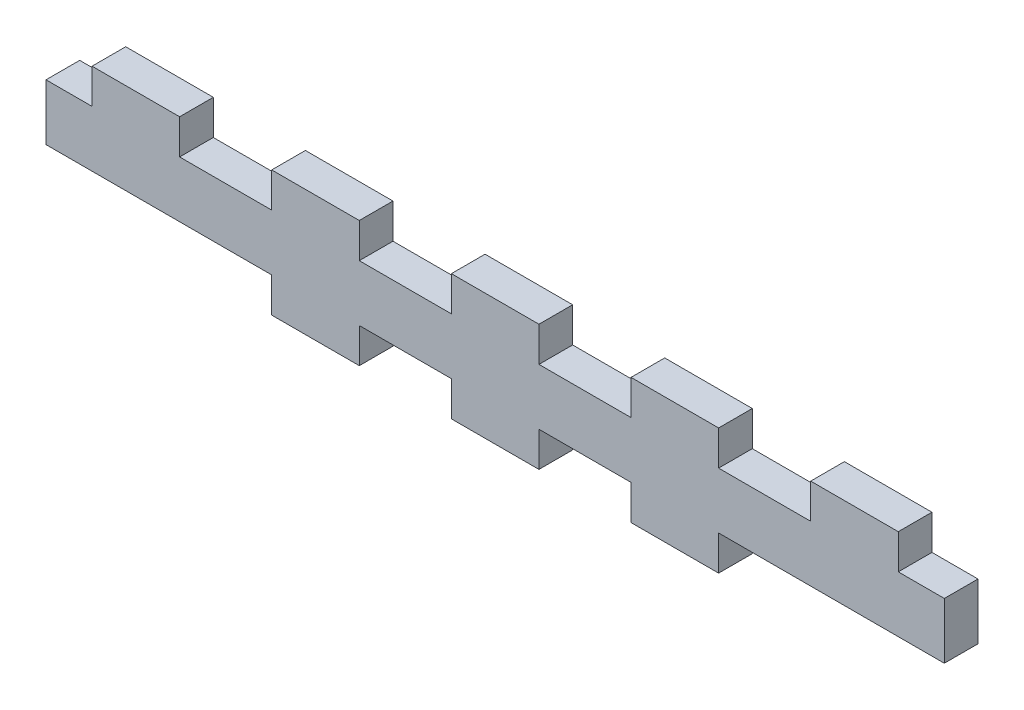
ISO-10303-21;
HEADER;
FILE_DESCRIPTION(('STEP AP214'),'2;1');
FILE_NAME('part.step','',(''),(''),'','','');
FILE_SCHEMA(('AUTOMOTIVE_DESIGN { 1 0 10303 214 1 1 1 1 }'));
ENDSEC;
DATA;
#1=APPLICATION_CONTEXT('core data for automotive mechanical design processes');
#2=APPLICATION_PROTOCOL_DEFINITION('international standard','automotive_design',2000,#1);
#3=PRODUCT_CONTEXT('',#1,'mechanical');
#4=PRODUCT('Part','Part','',(#3));
#5=PRODUCT_RELATED_PRODUCT_CATEGORY('part','',(#4));
#6=PRODUCT_DEFINITION_FORMATION('','',#4);
#7=PRODUCT_DEFINITION_CONTEXT('part definition',#1,'design');
#8=PRODUCT_DEFINITION('design','',#6,#7);
#9=PRODUCT_DEFINITION_SHAPE('','',#8);
#10=(LENGTH_UNIT() NAMED_UNIT(*) SI_UNIT(.MILLI.,.METRE.));
#11=(NAMED_UNIT(*) PLANE_ANGLE_UNIT() SI_UNIT($,.RADIAN.));
#12=(NAMED_UNIT(*) SI_UNIT($,.STERADIAN.) SOLID_ANGLE_UNIT());
#13=UNCERTAINTY_MEASURE_WITH_UNIT(LENGTH_MEASURE(1.E-05),#10,'distance_accuracy_value','');
#14=(GEOMETRIC_REPRESENTATION_CONTEXT(3) GLOBAL_UNCERTAINTY_ASSIGNED_CONTEXT((#13)) GLOBAL_UNIT_ASSIGNED_CONTEXT((#10,
#11,#12)) REPRESENTATION_CONTEXT('',''));
#15=CARTESIAN_POINT('',(0.,0.,0.));
#16=DIRECTION('',(0.,0.,1.));
#17=DIRECTION('',(1.,0.,0.));
#18=AXIS2_PLACEMENT_3D('',#15,#16,#17);
#19=CARTESIAN_POINT('',(0.,0.,2.99999999999999));
#20=DIRECTION('',(0.,0.,1.));
#21=DIRECTION('',(1.,0.,0.));
#22=AXIS2_PLACEMENT_3D('',#19,#20,#21);
#23=PLANE('',#22);
#24=DIRECTION('',(1.,0.,0.));
#25=VECTOR('',#24,1.);
#26=CARTESIAN_POINT('',(75.9000000000001,-3.10000000000001,2.99999999999999));
#27=LINE('',#26,#25);
#28=CARTESIAN_POINT('',(75.9000000000001,-3.10000000000001,2.99999999999999));
#29=VERTEX_POINT('',#28);
#30=CARTESIAN_POINT('',(80.,-3.10000000000001,2.99999999999999));
#31=VERTEX_POINT('',#30);
#32=EDGE_CURVE('E48',#29,#31,#27,.T.);
#33=ORIENTED_EDGE('',*,*,#32,.F.);
#34=DIRECTION('',(0.,-1.,0.));
#35=VECTOR('',#34,1.);
#36=CARTESIAN_POINT('',(75.9000000000001,0.1,2.99999999999999));
#37=LINE('',#36,#35);
#38=CARTESIAN_POINT('',(75.9000000000001,0.,2.99999999999999));
#39=VERTEX_POINT('',#38);
#40=EDGE_CURVE('E266',#39,#29,#37,.T.);
#41=ORIENTED_EDGE('',*,*,#40,.F.);
#42=DIRECTION('',(-1.,0.,0.));
#43=VECTOR('',#42,1.);
#44=CARTESIAN_POINT('',(0.,0.,2.99999999999999));
#45=LINE('',#44,#43);
#46=CARTESIAN_POINT('',(68.1000000000001,0.,2.99999999999999));
#47=VERTEX_POINT('',#46);
#48=EDGE_CURVE('E459',#39,#47,#45,.T.);
#49=ORIENTED_EDGE('',*,*,#48,.T.);
#50=DIRECTION('',(0.,1.,0.));
#51=VECTOR('',#50,1.);
#52=CARTESIAN_POINT('',(68.1000000000001,-3.10000000000001,2.99999999999999));
#53=LINE('',#52,#51);
#54=CARTESIAN_POINT('',(68.1000000000001,-3.10000000000001,2.99999999999999));
#55=VERTEX_POINT('',#54);
#56=EDGE_CURVE('E312',#55,#47,#53,.T.);
#57=ORIENTED_EDGE('',*,*,#56,.F.);
#58=DIRECTION('',(1.,0.,0.));
#59=VECTOR('',#58,1.);
#60=CARTESIAN_POINT('',(59.9000000000001,-3.10000000000001,2.99999999999999));
#61=LINE('',#60,#59);
#62=CARTESIAN_POINT('',(59.9000000000001,-3.10000000000001,2.99999999999999));
#63=VERTEX_POINT('',#62);
#64=EDGE_CURVE('E309',#63,#55,#61,.T.);
#65=ORIENTED_EDGE('',*,*,#64,.F.);
#66=DIRECTION('',(0.,-1.,0.));
#67=VECTOR('',#66,1.);
#68=CARTESIAN_POINT('',(59.9000000000001,0.1,2.99999999999999));
#69=LINE('',#68,#67);
#70=CARTESIAN_POINT('',(59.9000000000001,0.,2.99999999999999));
#71=VERTEX_POINT('',#70);
#72=EDGE_CURVE('E307',#71,#63,#69,.T.);
#73=ORIENTED_EDGE('',*,*,#72,.F.);
#74=CARTESIAN_POINT('',(52.1000000000001,0.,2.99999999999999));
#75=VERTEX_POINT('',#74);
#76=EDGE_CURVE('E462',#71,#75,#45,.T.);
#77=ORIENTED_EDGE('',*,*,#76,.T.);
#78=DIRECTION('',(0.,1.,0.));
#79=VECTOR('',#78,1.);
#80=CARTESIAN_POINT('',(52.1000000000001,-3.10000000000001,2.99999999999999));
#81=LINE('',#80,#79);
#82=CARTESIAN_POINT('',(52.1000000000001,-3.10000000000001,2.99999999999999));
#83=VERTEX_POINT('',#82);
#84=EDGE_CURVE('E56',#83,#75,#81,.T.);
#85=ORIENTED_EDGE('',*,*,#84,.F.);
#86=DIRECTION('',(1.,0.,0.));
#87=VECTOR('',#86,1.);
#88=CARTESIAN_POINT('',(43.9,-3.10000000000001,2.99999999999999));
#89=LINE('',#88,#87);
#90=CARTESIAN_POINT('',(43.9,-3.10000000000001,2.99999999999999));
#91=VERTEX_POINT('',#90);
#92=EDGE_CURVE('E291',#91,#83,#89,.T.);
#93=ORIENTED_EDGE('',*,*,#92,.F.);
#94=DIRECTION('',(0.,-1.,0.));
#95=VECTOR('',#94,1.);
#96=CARTESIAN_POINT('',(43.9,0.1,2.99999999999999));
#97=LINE('',#96,#95);
#98=CARTESIAN_POINT('',(43.9,0.,2.99999999999999));
#99=VERTEX_POINT('',#98);
#100=EDGE_CURVE('E289',#99,#91,#97,.T.);
#101=ORIENTED_EDGE('',*,*,#100,.F.);
#102=CARTESIAN_POINT('',(36.1,0.,2.99999999999999));
#103=VERTEX_POINT('',#102);
#104=EDGE_CURVE('E463',#99,#103,#45,.T.);
#105=ORIENTED_EDGE('',*,*,#104,.T.);
#106=DIRECTION('',(0.,1.,0.));
#107=VECTOR('',#106,1.);
#108=CARTESIAN_POINT('',(36.1,-3.10000000000001,2.99999999999999));
#109=LINE('',#108,#107);
#110=CARTESIAN_POINT('',(36.1,-3.10000000000001,2.99999999999999));
#111=VERTEX_POINT('',#110);
#112=EDGE_CURVE('E399',#111,#103,#109,.T.);
#113=ORIENTED_EDGE('',*,*,#112,.F.);
#114=DIRECTION('',(1.,0.,0.));
#115=VECTOR('',#114,1.);
#116=CARTESIAN_POINT('',(27.9,-3.10000000000001,2.99999999999999));
#117=LINE('',#116,#115);
#118=CARTESIAN_POINT('',(27.9,-3.10000000000001,2.99999999999999));
#119=VERTEX_POINT('',#118);
#120=EDGE_CURVE('E405',#119,#111,#117,.T.);
#121=ORIENTED_EDGE('',*,*,#120,.F.);
#122=DIRECTION('',(0.,-1.,0.));
#123=VECTOR('',#122,1.);
#124=CARTESIAN_POINT('',(27.9,0.1,2.99999999999999));
#125=LINE('',#124,#123);
#126=CARTESIAN_POINT('',(27.9,0.,2.99999999999999));
#127=VERTEX_POINT('',#126);
#128=EDGE_CURVE('E402',#127,#119,#125,.T.);
#129=ORIENTED_EDGE('',*,*,#128,.F.);
#130=CARTESIAN_POINT('',(20.1,0.,2.99999999999999));
#131=VERTEX_POINT('',#130);
#132=EDGE_CURVE('E464',#127,#131,#45,.T.);
#133=ORIENTED_EDGE('',*,*,#132,.T.);
#134=DIRECTION('',(0.,1.,0.));
#135=VECTOR('',#134,1.);
#136=CARTESIAN_POINT('',(20.1,-3.10000000000001,2.99999999999999));
#137=LINE('',#136,#135);
#138=CARTESIAN_POINT('',(20.1,-3.10000000000001,2.99999999999999));
#139=VERTEX_POINT('',#138);
#140=EDGE_CURVE('E380',#139,#131,#137,.T.);
#141=ORIENTED_EDGE('',*,*,#140,.F.);
#142=DIRECTION('',(1.,0.,0.));
#143=VECTOR('',#142,1.);
#144=CARTESIAN_POINT('',(11.8999999999999,-3.10000000000001,2.99999999999999));
#145=LINE('',#144,#143);
#146=CARTESIAN_POINT('',(11.8999999999999,-3.10000000000001,2.99999999999999));
#147=VERTEX_POINT('',#146);
#148=EDGE_CURVE('E385',#147,#139,#145,.T.);
#149=ORIENTED_EDGE('',*,*,#148,.F.);
#150=DIRECTION('',(0.,-1.,0.));
#151=VECTOR('',#150,1.);
#152=CARTESIAN_POINT('',(11.8999999999999,0.1,2.99999999999999));
#153=LINE('',#152,#151);
#154=CARTESIAN_POINT('',(11.8999999999999,0.,2.99999999999999));
#155=VERTEX_POINT('',#154);
#156=EDGE_CURVE('E382',#155,#147,#153,.T.);
#157=ORIENTED_EDGE('',*,*,#156,.F.);
#158=CARTESIAN_POINT('',(4.09999999999991,0.,2.99999999999999));
#159=VERTEX_POINT('',#158);
#160=EDGE_CURVE('E458',#155,#159,#45,.T.);
#161=ORIENTED_EDGE('',*,*,#160,.T.);
#162=DIRECTION('',(0.,1.,0.));
#163=VECTOR('',#162,1.);
#164=CARTESIAN_POINT('',(4.09999999999991,-3.10000000000001,2.99999999999999));
#165=LINE('',#164,#163);
#166=CARTESIAN_POINT('',(4.09999999999991,-3.10000000000001,2.99999999999999));
#167=VERTEX_POINT('',#166);
#168=EDGE_CURVE('E421',#167,#159,#165,.T.);
#169=ORIENTED_EDGE('',*,*,#168,.F.);
#170=DIRECTION('',(1.,0.,0.));
#171=VECTOR('',#170,1.);
#172=CARTESIAN_POINT('',(-0.0999999999999931,-3.10000000000001,2.99999999999999));
#173=LINE('',#172,#171);
#174=CARTESIAN_POINT('',(0.,-3.10000000000001,2.99999999999999));
#175=VERTEX_POINT('',#174);
#176=EDGE_CURVE('E419',#175,#167,#173,.T.);
#177=ORIENTED_EDGE('',*,*,#176,.F.);
#178=DIRECTION('',(0.,-1.,0.));
#179=VECTOR('',#178,1.);
#180=CARTESIAN_POINT('',(0.,0.,2.99999999999999));
#181=LINE('',#180,#179);
#182=CARTESIAN_POINT('',(0.,-8.09999999999999,2.99999999999999));
#183=VERTEX_POINT('',#182);
#184=EDGE_CURVE('E449',#175,#183,#181,.T.);
#185=ORIENTED_EDGE('',*,*,#184,.T.);
#186=DIRECTION('',(-1.,0.,0.));
#187=VECTOR('',#186,1.);
#188=CARTESIAN_POINT('',(20.1,-8.09999999999999,2.99999999999999));
#189=LINE('',#188,#187);
#190=CARTESIAN_POINT('',(20.1,-8.09999999999999,2.99999999999999));
#191=VERTEX_POINT('',#190);
#192=EDGE_CURVE('E436',#191,#183,#189,.T.);
#193=ORIENTED_EDGE('',*,*,#192,.F.);
#194=DIRECTION('',(0.,1.,0.));
#195=VECTOR('',#194,1.);
#196=CARTESIAN_POINT('',(20.1,-11.3,2.99999999999999));
#197=LINE('',#196,#195);
#198=CARTESIAN_POINT('',(20.1,-11.2,2.99999999999999));
#199=VERTEX_POINT('',#198);
#200=EDGE_CURVE('E434',#199,#191,#197,.T.);
#201=ORIENTED_EDGE('',*,*,#200,.F.);
#202=DIRECTION('',(1.,0.,0.));
#203=VECTOR('',#202,1.);
#204=CARTESIAN_POINT('',(0.,-11.2,2.99999999999999));
#205=LINE('',#204,#203);
#206=CARTESIAN_POINT('',(27.9,-11.2,2.99999999999999));
#207=VERTEX_POINT('',#206);
#208=EDGE_CURVE('E453',#199,#207,#205,.T.);
#209=ORIENTED_EDGE('',*,*,#208,.T.);
#210=DIRECTION('',(0.,-1.,0.));
#211=VECTOR('',#210,1.);
#212=CARTESIAN_POINT('',(27.9,-8.09999999999999,2.99999999999999));
#213=LINE('',#212,#211);
#214=CARTESIAN_POINT('',(27.9,-8.09999999999999,2.99999999999999));
#215=VERTEX_POINT('',#214);
#216=EDGE_CURVE('E344',#215,#207,#213,.T.);
#217=ORIENTED_EDGE('',*,*,#216,.F.);
#218=DIRECTION('',(-1.,0.,0.));
#219=VECTOR('',#218,1.);
#220=CARTESIAN_POINT('',(36.1,-8.09999999999999,2.99999999999999));
#221=LINE('',#220,#219);
#222=CARTESIAN_POINT('',(36.1,-8.09999999999999,2.99999999999999));
#223=VERTEX_POINT('',#222);
#224=EDGE_CURVE('E341',#223,#215,#221,.T.);
#225=ORIENTED_EDGE('',*,*,#224,.F.);
#226=DIRECTION('',(0.,1.,0.));
#227=VECTOR('',#226,1.);
#228=CARTESIAN_POINT('',(36.1,-11.3,2.99999999999999));
#229=LINE('',#228,#227);
#230=CARTESIAN_POINT('',(36.1,-11.2,2.99999999999999));
#231=VERTEX_POINT('',#230);
#232=EDGE_CURVE('E339',#231,#223,#229,.T.);
#233=ORIENTED_EDGE('',*,*,#232,.F.);
#234=CARTESIAN_POINT('',(43.9,-11.2,2.99999999999999));
#235=VERTEX_POINT('',#234);
#236=EDGE_CURVE('E456',#231,#235,#205,.T.);
#237=ORIENTED_EDGE('',*,*,#236,.T.);
#238=DIRECTION('',(0.,-1.,0.));
#239=VECTOR('',#238,1.);
#240=CARTESIAN_POINT('',(43.9,-8.09999999999999,2.99999999999999));
#241=LINE('',#240,#239);
#242=CARTESIAN_POINT('',(43.9,-8.09999999999999,2.99999999999999));
#243=VERTEX_POINT('',#242);
#244=EDGE_CURVE('E361',#243,#235,#241,.T.);
#245=ORIENTED_EDGE('',*,*,#244,.F.);
#246=DIRECTION('',(-1.,0.,0.));
#247=VECTOR('',#246,1.);
#248=CARTESIAN_POINT('',(52.1000000000001,-8.09999999999999,2.99999999999999));
#249=LINE('',#248,#247);
#250=CARTESIAN_POINT('',(52.1000000000001,-8.09999999999999,2.99999999999999));
#251=VERTEX_POINT('',#250);
#252=EDGE_CURVE('E359',#251,#243,#249,.T.);
#253=ORIENTED_EDGE('',*,*,#252,.F.);
#254=DIRECTION('',(0.,1.,0.));
#255=VECTOR('',#254,1.);
#256=CARTESIAN_POINT('',(52.1000000000001,-11.3,2.99999999999999));
#257=LINE('',#256,#255);
#258=CARTESIAN_POINT('',(52.1000000000001,-11.2,2.99999999999999));
#259=VERTEX_POINT('',#258);
#260=EDGE_CURVE('E365',#259,#251,#257,.T.);
#261=ORIENTED_EDGE('',*,*,#260,.F.);
#262=CARTESIAN_POINT('',(59.9000000000001,-11.2,2.99999999999999));
#263=VERTEX_POINT('',#262);
#264=EDGE_CURVE('E451',#259,#263,#205,.T.);
#265=ORIENTED_EDGE('',*,*,#264,.T.);
#266=DIRECTION('',(0.,-1.,0.));
#267=VECTOR('',#266,1.);
#268=CARTESIAN_POINT('',(59.9000000000001,-8.09999999999999,2.99999999999999));
#269=LINE('',#268,#267);
#270=CARTESIAN_POINT('',(59.9000000000001,-8.09999999999999,2.99999999999999));
#271=VERTEX_POINT('',#270);
#272=EDGE_CURVE('E329',#271,#263,#269,.T.);
#273=ORIENTED_EDGE('',*,*,#272,.F.);
#274=DIRECTION('',(-1.,0.,0.));
#275=VECTOR('',#274,1.);
#276=CARTESIAN_POINT('',(80.1,-8.09999999999999,2.99999999999999));
#277=LINE('',#276,#275);
#278=CARTESIAN_POINT('',(80.,-8.09999999999999,2.99999999999999));
#279=VERTEX_POINT('',#278);
#280=EDGE_CURVE('E327',#279,#271,#277,.T.);
#281=ORIENTED_EDGE('',*,*,#280,.F.);
#282=DIRECTION('',(0.,1.,0.));
#283=VECTOR('',#282,1.);
#284=CARTESIAN_POINT('',(80.,0.,2.99999999999999));
#285=LINE('',#284,#283);
#286=EDGE_CURVE('E283',#279,#31,#285,.T.);
#287=ORIENTED_EDGE('',*,*,#286,.T.);
#288=EDGE_LOOP('',(#33,#41,#49,#57,#65,#73,#77,#85,#93,#101,#105,#113,#121,#129,#133,#141,#149,
#157,#161,#169,#177,#185,#193,#201,#209,#217,#225,#233,#237,#245,#253,#261,#265,#273,#281,#287));
#289=FACE_BOUND('',#288,.T.);
#290=ADVANCED_FACE('F33',(#289),#23,.T.);
#291=CARTESIAN_POINT('',(0.,0.,0.));
#292=DIRECTION('',(0.,0.,1.));
#293=DIRECTION('',(1.,0.,0.));
#294=AXIS2_PLACEMENT_3D('',#291,#292,#293);
#295=PLANE('',#294);
#296=DIRECTION('',(0.,-1.,0.));
#297=VECTOR('',#296,1.);
#298=CARTESIAN_POINT('',(75.9000000000001,0.1,0.));
#299=LINE('',#298,#297);
#300=CARTESIAN_POINT('',(75.9000000000001,0.,0.));
#301=VERTEX_POINT('',#300);
#302=CARTESIAN_POINT('',(75.9000000000001,-3.10000000000001,0.));
#303=VERTEX_POINT('',#302);
#304=EDGE_CURVE('E286',#301,#303,#299,.T.);
#305=ORIENTED_EDGE('',*,*,#304,.T.);
#306=DIRECTION('',(1.,0.,0.));
#307=VECTOR('',#306,1.);
#308=CARTESIAN_POINT('',(75.9000000000001,-3.10000000000001,0.));
#309=LINE('',#308,#307);
#310=CARTESIAN_POINT('',(80.,-3.10000000000001,0.));
#311=VERTEX_POINT('',#310);
#312=EDGE_CURVE('E273',#303,#311,#309,.T.);
#313=ORIENTED_EDGE('',*,*,#312,.T.);
#314=DIRECTION('',(0.,1.,0.));
#315=VECTOR('',#314,1.);
#316=CARTESIAN_POINT('',(80.,0.,0.));
#317=LINE('',#316,#315);
#318=CARTESIAN_POINT('',(80.,-8.09999999999999,0.));
#319=VERTEX_POINT('',#318);
#320=EDGE_CURVE('E470',#319,#311,#317,.T.);
#321=ORIENTED_EDGE('',*,*,#320,.F.);
#322=DIRECTION('',(-1.,0.,0.));
#323=VECTOR('',#322,1.);
#324=CARTESIAN_POINT('',(80.1,-8.09999999999999,0.));
#325=LINE('',#324,#323);
#326=CARTESIAN_POINT('',(59.9000000000001,-8.09999999999999,0.));
#327=VERTEX_POINT('',#326);
#328=EDGE_CURVE('E326',#319,#327,#325,.T.);
#329=ORIENTED_EDGE('',*,*,#328,.T.);
#330=DIRECTION('',(0.,-1.,0.));
#331=VECTOR('',#330,1.);
#332=CARTESIAN_POINT('',(59.9000000000001,-8.09999999999999,0.));
#333=LINE('',#332,#331);
#334=CARTESIAN_POINT('',(59.9000000000001,-11.2,0.));
#335=VERTEX_POINT('',#334);
#336=EDGE_CURVE('E330',#327,#335,#333,.T.);
#337=ORIENTED_EDGE('',*,*,#336,.T.);
#338=DIRECTION('',(1.,0.,0.));
#339=VECTOR('',#338,1.);
#340=CARTESIAN_POINT('',(0.,-11.2,0.));
#341=LINE('',#340,#339);
#342=CARTESIAN_POINT('',(52.1000000000001,-11.2,0.));
#343=VERTEX_POINT('',#342);
#344=EDGE_CURVE('E466',#343,#335,#341,.T.);
#345=ORIENTED_EDGE('',*,*,#344,.F.);
#346=DIRECTION('',(0.,1.,0.));
#347=VECTOR('',#346,1.);
#348=CARTESIAN_POINT('',(52.1000000000001,-11.3,0.));
#349=LINE('',#348,#347);
#350=CARTESIAN_POINT('',(52.1000000000001,-8.09999999999999,0.));
#351=VERTEX_POINT('',#350);
#352=EDGE_CURVE('E362',#343,#351,#349,.T.);
#353=ORIENTED_EDGE('',*,*,#352,.T.);
#354=DIRECTION('',(-1.,0.,0.));
#355=VECTOR('',#354,1.);
#356=CARTESIAN_POINT('',(52.1000000000001,-8.09999999999999,0.));
#357=LINE('',#356,#355);
#358=CARTESIAN_POINT('',(43.9,-8.09999999999999,0.));
#359=VERTEX_POINT('',#358);
#360=EDGE_CURVE('E358',#351,#359,#357,.T.);
#361=ORIENTED_EDGE('',*,*,#360,.T.);
#362=DIRECTION('',(0.,-1.,0.));
#363=VECTOR('',#362,1.);
#364=CARTESIAN_POINT('',(43.9,-8.09999999999999,0.));
#365=LINE('',#364,#363);
#366=CARTESIAN_POINT('',(43.9,-11.2,0.));
#367=VERTEX_POINT('',#366);
#368=EDGE_CURVE('E370',#359,#367,#365,.T.);
#369=ORIENTED_EDGE('',*,*,#368,.T.);
#370=CARTESIAN_POINT('',(36.1,-11.2,0.));
#371=VERTEX_POINT('',#370);
#372=EDGE_CURVE('E471',#371,#367,#341,.T.);
#373=ORIENTED_EDGE('',*,*,#372,.F.);
#374=DIRECTION('',(0.,1.,0.));
#375=VECTOR('',#374,1.);
#376=CARTESIAN_POINT('',(36.1,-11.3,0.));
#377=LINE('',#376,#375);
#378=CARTESIAN_POINT('',(36.1,-8.09999999999999,0.));
#379=VERTEX_POINT('',#378);
#380=EDGE_CURVE('E338',#371,#379,#377,.T.);
#381=ORIENTED_EDGE('',*,*,#380,.T.);
#382=DIRECTION('',(-1.,0.,0.));
#383=VECTOR('',#382,1.);
#384=CARTESIAN_POINT('',(36.1,-8.09999999999999,0.));
#385=LINE('',#384,#383);
#386=CARTESIAN_POINT('',(27.9,-8.09999999999999,0.));
#387=VERTEX_POINT('',#386);
#388=EDGE_CURVE('E349',#379,#387,#385,.T.);
#389=ORIENTED_EDGE('',*,*,#388,.T.);
#390=DIRECTION('',(0.,-1.,0.));
#391=VECTOR('',#390,1.);
#392=CARTESIAN_POINT('',(27.9,-8.09999999999999,0.));
#393=LINE('',#392,#391);
#394=CARTESIAN_POINT('',(27.9,-11.2,0.));
#395=VERTEX_POINT('',#394);
#396=EDGE_CURVE('E342',#387,#395,#393,.T.);
#397=ORIENTED_EDGE('',*,*,#396,.T.);
#398=CARTESIAN_POINT('',(20.1,-11.2,0.));
#399=VERTEX_POINT('',#398);
#400=EDGE_CURVE('E467',#399,#395,#341,.T.);
#401=ORIENTED_EDGE('',*,*,#400,.F.);
#402=DIRECTION('',(0.,-1.,0.));
#403=VECTOR('',#402,1.);
#404=CARTESIAN_POINT('',(20.1,0.,0.));
#405=LINE('',#404,#403);
#406=CARTESIAN_POINT('',(20.1,-8.09999999999999,0.));
#407=VERTEX_POINT('',#406);
#408=EDGE_CURVE('E461',#407,#399,#405,.T.);
#409=ORIENTED_EDGE('',*,*,#408,.F.);
#410=DIRECTION('',(-1.,0.,0.));
#411=VECTOR('',#410,1.);
#412=CARTESIAN_POINT('',(20.1,-8.09999999999999,0.));
#413=LINE('',#412,#411);
#414=CARTESIAN_POINT('',(0.,-8.09999999999999,0.));
#415=VERTEX_POINT('',#414);
#416=EDGE_CURVE('E433',#407,#415,#413,.T.);
#417=ORIENTED_EDGE('',*,*,#416,.T.);
#418=DIRECTION('',(0.,-1.,0.));
#419=VECTOR('',#418,1.);
#420=CARTESIAN_POINT('',(0.,0.,0.));
#421=LINE('',#420,#419);
#422=CARTESIAN_POINT('',(0.,-3.10000000000001,0.));
#423=VERTEX_POINT('',#422);
#424=EDGE_CURVE('E448',#423,#415,#421,.T.);
#425=ORIENTED_EDGE('',*,*,#424,.F.);
#426=DIRECTION('',(1.,0.,0.));
#427=VECTOR('',#426,1.);
#428=CARTESIAN_POINT('',(-0.0999999999999931,-3.10000000000001,0.));
#429=LINE('',#428,#427);
#430=CARTESIAN_POINT('',(4.09999999999991,-3.10000000000001,0.));
#431=VERTEX_POINT('',#430);
#432=EDGE_CURVE('E418',#423,#431,#429,.T.);
#433=ORIENTED_EDGE('',*,*,#432,.T.);
#434=DIRECTION('',(0.,1.,0.));
#435=VECTOR('',#434,1.);
#436=CARTESIAN_POINT('',(4.09999999999991,-3.10000000000001,0.));
#437=LINE('',#436,#435);
#438=CARTESIAN_POINT('',(4.09999999999991,0.,0.));
#439=VERTEX_POINT('',#438);
#440=EDGE_CURVE('E422',#431,#439,#437,.T.);
#441=ORIENTED_EDGE('',*,*,#440,.T.);
#442=DIRECTION('',(-1.,0.,0.));
#443=VECTOR('',#442,1.);
#444=CARTESIAN_POINT('',(0.,0.,0.));
#445=LINE('',#444,#443);
#446=CARTESIAN_POINT('',(11.8999999999999,0.,0.));
#447=VERTEX_POINT('',#446);
#448=EDGE_CURVE('E474',#447,#439,#445,.T.);
#449=ORIENTED_EDGE('',*,*,#448,.F.);
#450=DIRECTION('',(0.,-1.,0.));
#451=VECTOR('',#450,1.);
#452=CARTESIAN_POINT('',(11.8999999999999,0.1,0.));
#453=LINE('',#452,#451);
#454=CARTESIAN_POINT('',(11.8999999999999,-3.10000000000001,0.));
#455=VERTEX_POINT('',#454);
#456=EDGE_CURVE('E390',#447,#455,#453,.T.);
#457=ORIENTED_EDGE('',*,*,#456,.T.);
#458=DIRECTION('',(1.,0.,0.));
#459=VECTOR('',#458,1.);
#460=CARTESIAN_POINT('',(11.8999999999999,-3.10000000000001,0.));
#461=LINE('',#460,#459);
#462=CARTESIAN_POINT('',(20.1,-3.10000000000001,0.));
#463=VERTEX_POINT('',#462);
#464=EDGE_CURVE('E383',#455,#463,#461,.T.);
#465=ORIENTED_EDGE('',*,*,#464,.T.);
#466=DIRECTION('',(0.,1.,0.));
#467=VECTOR('',#466,1.);
#468=CARTESIAN_POINT('',(20.1,-3.10000000000001,0.));
#469=LINE('',#468,#467);
#470=CARTESIAN_POINT('',(20.1,0.,0.));
#471=VERTEX_POINT('',#470);
#472=EDGE_CURVE('E379',#463,#471,#469,.T.);
#473=ORIENTED_EDGE('',*,*,#472,.T.);
#474=CARTESIAN_POINT('',(27.9,0.,0.));
#475=VERTEX_POINT('',#474);
#476=EDGE_CURVE('E478',#475,#471,#445,.T.);
#477=ORIENTED_EDGE('',*,*,#476,.F.);
#478=DIRECTION('',(0.,-1.,0.));
#479=VECTOR('',#478,1.);
#480=CARTESIAN_POINT('',(27.9,0.1,0.));
#481=LINE('',#480,#479);
#482=CARTESIAN_POINT('',(27.9,-3.10000000000001,0.));
#483=VERTEX_POINT('',#482);
#484=EDGE_CURVE('E410',#475,#483,#481,.T.);
#485=ORIENTED_EDGE('',*,*,#484,.T.);
#486=DIRECTION('',(1.,0.,0.));
#487=VECTOR('',#486,1.);
#488=CARTESIAN_POINT('',(27.9,-3.10000000000001,0.));
#489=LINE('',#488,#487);
#490=CARTESIAN_POINT('',(36.1,-3.10000000000001,0.));
#491=VERTEX_POINT('',#490);
#492=EDGE_CURVE('E403',#483,#491,#489,.T.);
#493=ORIENTED_EDGE('',*,*,#492,.T.);
#494=DIRECTION('',(0.,1.,0.));
#495=VECTOR('',#494,1.);
#496=CARTESIAN_POINT('',(36.1,-3.10000000000001,0.));
#497=LINE('',#496,#495);
#498=CARTESIAN_POINT('',(36.1,0.,0.));
#499=VERTEX_POINT('',#498);
#500=EDGE_CURVE('E398',#491,#499,#497,.T.);
#501=ORIENTED_EDGE('',*,*,#500,.T.);
#502=CARTESIAN_POINT('',(43.9,0.,0.));
#503=VERTEX_POINT('',#502);
#504=EDGE_CURVE('E477',#503,#499,#445,.T.);
#505=ORIENTED_EDGE('',*,*,#504,.F.);
#506=DIRECTION('',(0.,-1.,0.));
#507=VECTOR('',#506,1.);
#508=CARTESIAN_POINT('',(43.9,0.1,0.));
#509=LINE('',#508,#507);
#510=CARTESIAN_POINT('',(43.9,-3.10000000000001,0.));
#511=VERTEX_POINT('',#510);
#512=EDGE_CURVE('E278',#503,#511,#509,.T.);
#513=ORIENTED_EDGE('',*,*,#512,.T.);
#514=DIRECTION('',(1.,0.,0.));
#515=VECTOR('',#514,1.);
#516=CARTESIAN_POINT('',(43.9,-3.10000000000001,0.));
#517=LINE('',#516,#515);
#518=CARTESIAN_POINT('',(52.1000000000001,-3.10000000000001,0.));
#519=VERTEX_POINT('',#518);
#520=EDGE_CURVE('E298',#511,#519,#517,.T.);
#521=ORIENTED_EDGE('',*,*,#520,.T.);
#522=DIRECTION('',(0.,1.,0.));
#523=VECTOR('',#522,1.);
#524=CARTESIAN_POINT('',(52.1000000000001,-3.10000000000001,0.));
#525=LINE('',#524,#523);
#526=CARTESIAN_POINT('',(52.1000000000001,0.,0.));
#527=VERTEX_POINT('',#526);
#528=EDGE_CURVE('E292',#519,#527,#525,.T.);
#529=ORIENTED_EDGE('',*,*,#528,.T.);
#530=CARTESIAN_POINT('',(59.9000000000001,0.,0.));
#531=VERTEX_POINT('',#530);
#532=EDGE_CURVE('E476',#531,#527,#445,.T.);
#533=ORIENTED_EDGE('',*,*,#532,.F.);
#534=DIRECTION('',(0.,-1.,0.));
#535=VECTOR('',#534,1.);
#536=CARTESIAN_POINT('',(59.9000000000001,0.1,0.));
#537=LINE('',#536,#535);
#538=CARTESIAN_POINT('',(59.9000000000001,-3.10000000000001,0.));
#539=VERTEX_POINT('',#538);
#540=EDGE_CURVE('E306',#531,#539,#537,.T.);
#541=ORIENTED_EDGE('',*,*,#540,.T.);
#542=DIRECTION('',(1.,0.,0.));
#543=VECTOR('',#542,1.);
#544=CARTESIAN_POINT('',(59.9000000000001,-3.10000000000001,0.));
#545=LINE('',#544,#543);
#546=CARTESIAN_POINT('',(68.1000000000001,-3.10000000000001,0.));
#547=VERTEX_POINT('',#546);
#548=EDGE_CURVE('E318',#539,#547,#545,.T.);
#549=ORIENTED_EDGE('',*,*,#548,.T.);
#550=DIRECTION('',(0.,1.,0.));
#551=VECTOR('',#550,1.);
#552=CARTESIAN_POINT('',(68.1000000000001,-3.10000000000001,0.));
#553=LINE('',#552,#551);
#554=CARTESIAN_POINT('',(68.1000000000001,0.,0.));
#555=VERTEX_POINT('',#554);
#556=EDGE_CURVE('E310',#547,#555,#553,.T.);
#557=ORIENTED_EDGE('',*,*,#556,.T.);
#558=EDGE_CURVE('E452',#301,#555,#445,.T.);
#559=ORIENTED_EDGE('',*,*,#558,.F.);
#560=EDGE_LOOP('',(#305,#313,#321,#329,#337,#345,#353,#361,#369,#373,#381,#389,#397,#401,#409,
#417,#425,#433,#441,#449,#457,#465,#473,#477,#485,#493,#501,#505,#513,#521,#529,#533,#541,#549,
#557,#559));
#561=FACE_BOUND('',#560,.T.);
#562=ADVANCED_FACE('F516',(#561),#295,.F.);
#563=CARTESIAN_POINT('',(0.,0.,2.99999999999999));
#564=DIRECTION('',(0.,-1.,0.));
#565=DIRECTION('',(0.,0.,-1.));
#566=AXIS2_PLACEMENT_3D('',#563,#564,#565);
#567=PLANE('',#566);
#568=DIRECTION('',(0.,0.,1.));
#569=VECTOR('',#568,1.);
#570=CARTESIAN_POINT('',(75.9000000000001,0.,2.99999999999999));
#571=LINE('',#570,#569);
#572=EDGE_CURVE('E11',#301,#39,#571,.T.);
#573=ORIENTED_EDGE('',*,*,#572,.F.);
#574=ORIENTED_EDGE('',*,*,#558,.T.);
#575=DIRECTION('',(0.,0.,-1.));
#576=VECTOR('',#575,1.);
#577=CARTESIAN_POINT('',(68.1000000000001,0.,2.99999999999999));
#578=LINE('',#577,#576);
#579=EDGE_CURVE('E505',#47,#555,#578,.T.);
#580=ORIENTED_EDGE('',*,*,#579,.F.);
#581=ORIENTED_EDGE('',*,*,#48,.F.);
#582=EDGE_LOOP('',(#573,#574,#580,#581));
#583=FACE_BOUND('',#582,.T.);
#584=ADVANCED_FACE('F656',(#583),#567,.F.);
#585=CARTESIAN_POINT('',(80.,0.,2.99999999999999));
#586=DIRECTION('',(-1.,0.,0.));
#587=DIRECTION('',(0.,0.,1.));
#588=AXIS2_PLACEMENT_3D('',#585,#586,#587);
#589=PLANE('',#588);
#590=DIRECTION('',(0.,0.,-1.));
#591=VECTOR('',#590,1.);
#592=CARTESIAN_POINT('',(80.,-3.10000000000001,2.99999999999999));
#593=LINE('',#592,#591);
#594=EDGE_CURVE('E41',#31,#311,#593,.T.);
#595=ORIENTED_EDGE('',*,*,#594,.F.);
#596=ORIENTED_EDGE('',*,*,#286,.F.);
#597=DIRECTION('',(0.,0.,1.));
#598=VECTOR('',#597,1.);
#599=CARTESIAN_POINT('',(80.,-8.09999999999999,2.99999999999999));
#600=LINE('',#599,#598);
#601=EDGE_CURVE('E501',#319,#279,#600,.T.);
#602=ORIENTED_EDGE('',*,*,#601,.F.);
#603=ORIENTED_EDGE('',*,*,#320,.T.);
#604=EDGE_LOOP('',(#595,#596,#602,#603));
#605=FACE_BOUND('',#604,.T.);
#606=ADVANCED_FACE('F519',(#605),#589,.F.);
#607=DIRECTION('',(0.,0.,1.));
#608=VECTOR('',#607,1.);
#609=CARTESIAN_POINT('',(43.9,0.,2.99999999999999));
#610=LINE('',#609,#608);
#611=EDGE_CURVE('E512',#503,#99,#610,.T.);
#612=ORIENTED_EDGE('',*,*,#611,.F.);
#613=ORIENTED_EDGE('',*,*,#504,.T.);
#614=DIRECTION('',(0.,0.,-1.));
#615=VECTOR('',#614,1.);
#616=CARTESIAN_POINT('',(36.1,0.,2.99999999999999));
#617=LINE('',#616,#615);
#618=EDGE_CURVE('E485',#103,#499,#617,.T.);
#619=ORIENTED_EDGE('',*,*,#618,.F.);
#620=ORIENTED_EDGE('',*,*,#104,.F.);
#621=EDGE_LOOP('',(#612,#613,#619,#620));
#622=FACE_BOUND('',#621,.T.);
#623=ADVANCED_FACE('F605',(#622),#567,.F.);
#624=DIRECTION('',(0.,0.,-1.));
#625=VECTOR('',#624,1.);
#626=CARTESIAN_POINT('',(52.1000000000001,0.,2.99999999999999));
#627=LINE('',#626,#625);
#628=EDGE_CURVE('E510',#75,#527,#627,.T.);
#629=ORIENTED_EDGE('',*,*,#628,.F.);
#630=ORIENTED_EDGE('',*,*,#76,.F.);
#631=DIRECTION('',(0.,0.,1.));
#632=VECTOR('',#631,1.);
#633=CARTESIAN_POINT('',(59.9000000000001,0.,2.99999999999999));
#634=LINE('',#633,#632);
#635=EDGE_CURVE('E508',#531,#71,#634,.T.);
#636=ORIENTED_EDGE('',*,*,#635,.F.);
#637=ORIENTED_EDGE('',*,*,#532,.T.);
#638=EDGE_LOOP('',(#629,#630,#636,#637));
#639=FACE_BOUND('',#638,.T.);
#640=ADVANCED_FACE('F663',(#639),#567,.F.);
#641=CARTESIAN_POINT('',(0.,-11.2,2.99999999999999));
#642=DIRECTION('',(0.,1.,0.));
#643=DIRECTION('',(0.,0.,1.));
#644=AXIS2_PLACEMENT_3D('',#641,#642,#643);
#645=PLANE('',#644);
#646=DIRECTION('',(0.,0.,-1.));
#647=VECTOR('',#646,1.);
#648=CARTESIAN_POINT('',(59.9000000000001,-11.2,2.99999999999999));
#649=LINE('',#648,#647);
#650=EDGE_CURVE('E503',#263,#335,#649,.T.);
#651=ORIENTED_EDGE('',*,*,#650,.F.);
#652=ORIENTED_EDGE('',*,*,#264,.F.);
#653=DIRECTION('',(0.,0.,1.));
#654=VECTOR('',#653,1.);
#655=CARTESIAN_POINT('',(52.1000000000001,-11.2,2.99999999999999));
#656=LINE('',#655,#654);
#657=EDGE_CURVE('E492',#343,#259,#656,.T.);
#658=ORIENTED_EDGE('',*,*,#657,.F.);
#659=ORIENTED_EDGE('',*,*,#344,.T.);
#660=EDGE_LOOP('',(#651,#652,#658,#659));
#661=FACE_BOUND('',#660,.T.);
#662=ADVANCED_FACE('F533',(#661),#645,.F.);
#663=DIRECTION('',(0.,0.,1.));
#664=VECTOR('',#663,1.);
#665=CARTESIAN_POINT('',(36.1,-11.2,2.99999999999999));
#666=LINE('',#665,#664);
#667=EDGE_CURVE('E499',#371,#231,#666,.T.);
#668=ORIENTED_EDGE('',*,*,#667,.F.);
#669=ORIENTED_EDGE('',*,*,#372,.T.);
#670=DIRECTION('',(0.,0.,-1.));
#671=VECTOR('',#670,1.);
#672=CARTESIAN_POINT('',(43.9,-11.2,2.99999999999999));
#673=LINE('',#672,#671);
#674=EDGE_CURVE('E494',#235,#367,#673,.T.);
#675=ORIENTED_EDGE('',*,*,#674,.F.);
#676=ORIENTED_EDGE('',*,*,#236,.F.);
#677=EDGE_LOOP('',(#668,#669,#675,#676));
#678=FACE_BOUND('',#677,.T.);
#679=ADVANCED_FACE('F540',(#678),#645,.F.);
#680=DIRECTION('',(0.,0.,-1.));
#681=VECTOR('',#680,1.);
#682=CARTESIAN_POINT('',(27.9,-11.2,2.99999999999999));
#683=LINE('',#682,#681);
#684=EDGE_CURVE('E497',#207,#395,#683,.T.);
#685=ORIENTED_EDGE('',*,*,#684,.F.);
#686=ORIENTED_EDGE('',*,*,#208,.F.);
#687=DIRECTION('',(0.,0.,1.));
#688=VECTOR('',#687,1.);
#689=CARTESIAN_POINT('',(20.1,-11.2,2.99999999999999));
#690=LINE('',#689,#688);
#691=EDGE_CURVE('E446',#399,#199,#690,.T.);
#692=ORIENTED_EDGE('',*,*,#691,.F.);
#693=ORIENTED_EDGE('',*,*,#400,.T.);
#694=EDGE_LOOP('',(#685,#686,#692,#693));
#695=FACE_BOUND('',#694,.T.);
#696=ADVANCED_FACE('F567',(#695),#645,.F.);
#697=DIRECTION('',(0.,0.,-1.));
#698=VECTOR('',#697,1.);
#699=CARTESIAN_POINT('',(20.1,0.,2.99999999999999));
#700=LINE('',#699,#698);
#701=EDGE_CURVE('E490',#131,#471,#700,.T.);
#702=ORIENTED_EDGE('',*,*,#701,.F.);
#703=ORIENTED_EDGE('',*,*,#132,.F.);
#704=DIRECTION('',(0.,0.,1.));
#705=VECTOR('',#704,1.);
#706=CARTESIAN_POINT('',(27.9,0.,2.99999999999999));
#707=LINE('',#706,#705);
#708=EDGE_CURVE('E483',#475,#127,#707,.T.);
#709=ORIENTED_EDGE('',*,*,#708,.F.);
#710=ORIENTED_EDGE('',*,*,#476,.T.);
#711=EDGE_LOOP('',(#702,#703,#709,#710));
#712=FACE_BOUND('',#711,.T.);
#713=ADVANCED_FACE('F639',(#712),#567,.F.);
#714=DIRECTION('',(0.,0.,1.));
#715=VECTOR('',#714,1.);
#716=CARTESIAN_POINT('',(11.8999999999999,0.,2.99999999999999));
#717=LINE('',#716,#715);
#718=EDGE_CURVE('E488',#447,#155,#717,.T.);
#719=ORIENTED_EDGE('',*,*,#718,.F.);
#720=ORIENTED_EDGE('',*,*,#448,.T.);
#721=DIRECTION('',(0.,0.,-1.));
#722=VECTOR('',#721,1.);
#723=CARTESIAN_POINT('',(4.09999999999991,0.,2.99999999999999));
#724=LINE('',#723,#722);
#725=EDGE_CURVE('E480',#159,#439,#724,.T.);
#726=ORIENTED_EDGE('',*,*,#725,.F.);
#727=ORIENTED_EDGE('',*,*,#160,.F.);
#728=EDGE_LOOP('',(#719,#720,#726,#727));
#729=FACE_BOUND('',#728,.T.);
#730=ADVANCED_FACE('F595',(#729),#567,.F.);
#731=CARTESIAN_POINT('',(0.,0.,2.99999999999999));
#732=DIRECTION('',(1.,0.,0.));
#733=DIRECTION('',(0.,1.,0.));
#734=AXIS2_PLACEMENT_3D('',#731,#732,#733);
#735=PLANE('',#734);
#736=DIRECTION('',(0.,0.,1.));
#737=VECTOR('',#736,1.);
#738=CARTESIAN_POINT('',(0.,-3.10000000000001,2.99999999999999));
#739=LINE('',#738,#737);
#740=EDGE_CURVE('E431',#423,#175,#739,.T.);
#741=ORIENTED_EDGE('',*,*,#740,.F.);
#742=ORIENTED_EDGE('',*,*,#424,.T.);
#743=DIRECTION('',(0.,0.,-1.));
#744=VECTOR('',#743,1.);
#745=CARTESIAN_POINT('',(0.,-8.09999999999999,2.99999999999999));
#746=LINE('',#745,#744);
#747=EDGE_CURVE('E443',#183,#415,#746,.T.);
#748=ORIENTED_EDGE('',*,*,#747,.F.);
#749=ORIENTED_EDGE('',*,*,#184,.F.);
#750=EDGE_LOOP('',(#741,#742,#748,#749));
#751=FACE_BOUND('',#750,.T.);
#752=ADVANCED_FACE('F35',(#751),#735,.F.);
#753=CARTESIAN_POINT('',(20.1,-11.3,2.99999999999999));
#754=DIRECTION('',(-1.,0.,0.));
#755=DIRECTION('',(0.,0.,1.));
#756=AXIS2_PLACEMENT_3D('',#753,#754,#755);
#757=PLANE('',#756);
#758=ORIENTED_EDGE('',*,*,#691,.T.);
#759=ORIENTED_EDGE('',*,*,#200,.T.);
#760=DIRECTION('',(0.,0.,-1.));
#761=VECTOR('',#760,1.);
#762=CARTESIAN_POINT('',(20.1,-8.09999999999999,2.99999999999999));
#763=LINE('',#762,#761);
#764=EDGE_CURVE('E439',#191,#407,#763,.T.);
#765=ORIENTED_EDGE('',*,*,#764,.T.);
#766=ORIENTED_EDGE('',*,*,#408,.T.);
#767=EDGE_LOOP('',(#758,#759,#765,#766));
#768=FACE_BOUND('',#767,.T.);
#769=ADVANCED_FACE('F571',(#768),#757,.T.);
#770=CARTESIAN_POINT('',(20.1,-8.09999999999999,2.99999999999999));
#771=DIRECTION('',(0.,-1.,0.));
#772=DIRECTION('',(0.,0.,-1.));
#773=AXIS2_PLACEMENT_3D('',#770,#771,#772);
#774=PLANE('',#773);
#775=ORIENTED_EDGE('',*,*,#747,.T.);
#776=ORIENTED_EDGE('',*,*,#416,.F.);
#777=ORIENTED_EDGE('',*,*,#764,.F.);
#778=ORIENTED_EDGE('',*,*,#192,.T.);
#779=EDGE_LOOP('',(#775,#776,#777,#778));
#780=FACE_BOUND('',#779,.T.);
#781=ADVANCED_FACE('F578',(#780),#774,.T.);
#782=CARTESIAN_POINT('',(-0.0999999999999931,-3.10000000000001,2.99999999999999));
#783=DIRECTION('',(0.,1.,0.));
#784=DIRECTION('',(0.,0.,1.));
#785=AXIS2_PLACEMENT_3D('',#782,#783,#784);
#786=PLANE('',#785);
#787=ORIENTED_EDGE('',*,*,#740,.T.);
#788=ORIENTED_EDGE('',*,*,#176,.T.);
#789=DIRECTION('',(0.,0.,-1.));
#790=VECTOR('',#789,1.);
#791=CARTESIAN_POINT('',(4.09999999999991,-3.10000000000001,2.99999999999999));
#792=LINE('',#791,#790);
#793=EDGE_CURVE('E425',#167,#431,#792,.T.);
#794=ORIENTED_EDGE('',*,*,#793,.T.);
#795=ORIENTED_EDGE('',*,*,#432,.F.);
#796=EDGE_LOOP('',(#787,#788,#794,#795));
#797=FACE_BOUND('',#796,.T.);
#798=ADVANCED_FACE('F586',(#797),#786,.T.);
#799=CARTESIAN_POINT('',(4.09999999999991,-3.10000000000001,2.99999999999999));
#800=DIRECTION('',(-1.,0.,0.));
#801=DIRECTION('',(0.,0.,1.));
#802=AXIS2_PLACEMENT_3D('',#799,#800,#801);
#803=PLANE('',#802);
#804=ORIENTED_EDGE('',*,*,#725,.T.);
#805=ORIENTED_EDGE('',*,*,#440,.F.);
#806=ORIENTED_EDGE('',*,*,#793,.F.);
#807=ORIENTED_EDGE('',*,*,#168,.T.);
#808=EDGE_LOOP('',(#804,#805,#806,#807));
#809=FACE_BOUND('',#808,.T.);
#810=ADVANCED_FACE('F590',(#809),#803,.T.);
#811=CARTESIAN_POINT('',(36.1,-3.10000000000001,2.99999999999999));
#812=DIRECTION('',(-1.,0.,0.));
#813=DIRECTION('',(0.,0.,1.));
#814=AXIS2_PLACEMENT_3D('',#811,#812,#813);
#815=PLANE('',#814);
#816=ORIENTED_EDGE('',*,*,#618,.T.);
#817=ORIENTED_EDGE('',*,*,#500,.F.);
#818=DIRECTION('',(0.,0.,-1.));
#819=VECTOR('',#818,1.);
#820=CARTESIAN_POINT('',(36.1,-3.10000000000001,2.99999999999999));
#821=LINE('',#820,#819);
#822=EDGE_CURVE('E407',#111,#491,#821,.T.);
#823=ORIENTED_EDGE('',*,*,#822,.F.);
#824=ORIENTED_EDGE('',*,*,#112,.T.);
#825=EDGE_LOOP('',(#816,#817,#823,#824));
#826=FACE_BOUND('',#825,.T.);
#827=ADVANCED_FACE('F609',(#826),#815,.T.);
#828=CARTESIAN_POINT('',(27.9,0.1,2.99999999999999));
#829=DIRECTION('',(1.,0.,0.));
#830=DIRECTION('',(0.,0.,-1.));
#831=AXIS2_PLACEMENT_3D('',#828,#829,#830);
#832=PLANE('',#831);
#833=ORIENTED_EDGE('',*,*,#708,.T.);
#834=ORIENTED_EDGE('',*,*,#128,.T.);
#835=DIRECTION('',(0.,0.,-1.));
#836=VECTOR('',#835,1.);
#837=CARTESIAN_POINT('',(27.9,-3.10000000000001,2.99999999999999));
#838=LINE('',#837,#836);
#839=EDGE_CURVE('E416',#119,#483,#838,.T.);
#840=ORIENTED_EDGE('',*,*,#839,.T.);
#841=ORIENTED_EDGE('',*,*,#484,.F.);
#842=EDGE_LOOP('',(#833,#834,#840,#841));
#843=FACE_BOUND('',#842,.T.);
#844=ADVANCED_FACE('F641',(#843),#832,.T.);
#845=CARTESIAN_POINT('',(27.9,-3.10000000000001,2.99999999999999));
#846=DIRECTION('',(0.,1.,0.));
#847=DIRECTION('',(0.,0.,1.));
#848=AXIS2_PLACEMENT_3D('',#845,#846,#847);
#849=PLANE('',#848);
#850=ORIENTED_EDGE('',*,*,#492,.F.);
#851=ORIENTED_EDGE('',*,*,#839,.F.);
#852=ORIENTED_EDGE('',*,*,#120,.T.);
#853=ORIENTED_EDGE('',*,*,#822,.T.);
#854=EDGE_LOOP('',(#850,#851,#852,#853));
#855=FACE_BOUND('',#854,.T.);
#856=ADVANCED_FACE('F616',(#855),#849,.T.);
#857=CARTESIAN_POINT('',(20.1,-3.10000000000001,2.99999999999999));
#858=DIRECTION('',(-1.,0.,0.));
#859=DIRECTION('',(0.,0.,1.));
#860=AXIS2_PLACEMENT_3D('',#857,#858,#859);
#861=PLANE('',#860);
#862=ORIENTED_EDGE('',*,*,#701,.T.);
#863=ORIENTED_EDGE('',*,*,#472,.F.);
#864=DIRECTION('',(0.,0.,-1.));
#865=VECTOR('',#864,1.);
#866=CARTESIAN_POINT('',(20.1,-3.10000000000001,2.99999999999999));
#867=LINE('',#866,#865);
#868=EDGE_CURVE('E387',#139,#463,#867,.T.);
#869=ORIENTED_EDGE('',*,*,#868,.F.);
#870=ORIENTED_EDGE('',*,*,#140,.T.);
#871=EDGE_LOOP('',(#862,#863,#869,#870));
#872=FACE_BOUND('',#871,.T.);
#873=ADVANCED_FACE('F648',(#872),#861,.T.);
#874=CARTESIAN_POINT('',(11.8999999999999,0.1,2.99999999999999));
#875=DIRECTION('',(1.,0.,0.));
#876=DIRECTION('',(0.,0.,-1.));
#877=AXIS2_PLACEMENT_3D('',#874,#875,#876);
#878=PLANE('',#877);
#879=ORIENTED_EDGE('',*,*,#718,.T.);
#880=ORIENTED_EDGE('',*,*,#156,.T.);
#881=DIRECTION('',(0.,0.,-1.));
#882=VECTOR('',#881,1.);
#883=CARTESIAN_POINT('',(11.8999999999999,-3.10000000000001,2.99999999999999));
#884=LINE('',#883,#882);
#885=EDGE_CURVE('E396',#147,#455,#884,.T.);
#886=ORIENTED_EDGE('',*,*,#885,.T.);
#887=ORIENTED_EDGE('',*,*,#456,.F.);
#888=EDGE_LOOP('',(#879,#880,#886,#887));
#889=FACE_BOUND('',#888,.T.);
#890=ADVANCED_FACE('F629',(#889),#878,.T.);
#891=CARTESIAN_POINT('',(11.8999999999999,-3.10000000000001,2.99999999999999));
#892=DIRECTION('',(0.,1.,0.));
#893=DIRECTION('',(0.,0.,1.));
#894=AXIS2_PLACEMENT_3D('',#891,#892,#893);
#895=PLANE('',#894);
#896=ORIENTED_EDGE('',*,*,#464,.F.);
#897=ORIENTED_EDGE('',*,*,#885,.F.);
#898=ORIENTED_EDGE('',*,*,#148,.T.);
#899=ORIENTED_EDGE('',*,*,#868,.T.);
#900=EDGE_LOOP('',(#896,#897,#898,#899));
#901=FACE_BOUND('',#900,.T.);
#902=ADVANCED_FACE('F632',(#901),#895,.T.);
#903=CARTESIAN_POINT('',(43.9,-8.09999999999999,2.99999999999999));
#904=DIRECTION('',(1.,0.,0.));
#905=DIRECTION('',(0.,0.,-1.));
#906=AXIS2_PLACEMENT_3D('',#903,#904,#905);
#907=PLANE('',#906);
#908=ORIENTED_EDGE('',*,*,#674,.T.);
#909=ORIENTED_EDGE('',*,*,#368,.F.);
#910=DIRECTION('',(0.,0.,-1.));
#911=VECTOR('',#910,1.);
#912=CARTESIAN_POINT('',(43.9,-8.09999999999999,2.99999999999999));
#913=LINE('',#912,#911);
#914=EDGE_CURVE('E376',#243,#359,#913,.T.);
#915=ORIENTED_EDGE('',*,*,#914,.F.);
#916=ORIENTED_EDGE('',*,*,#244,.T.);
#917=EDGE_LOOP('',(#908,#909,#915,#916));
#918=FACE_BOUND('',#917,.T.);
#919=ADVANCED_FACE('F543',(#918),#907,.T.);
#920=CARTESIAN_POINT('',(52.1000000000001,-11.3,2.99999999999999));
#921=DIRECTION('',(-1.,0.,0.));
#922=DIRECTION('',(0.,0.,1.));
#923=AXIS2_PLACEMENT_3D('',#920,#921,#922);
#924=PLANE('',#923);
#925=ORIENTED_EDGE('',*,*,#657,.T.);
#926=ORIENTED_EDGE('',*,*,#260,.T.);
#927=DIRECTION('',(0.,0.,-1.));
#928=VECTOR('',#927,1.);
#929=CARTESIAN_POINT('',(52.1000000000001,-8.09999999999999,2.99999999999999));
#930=LINE('',#929,#928);
#931=EDGE_CURVE('E367',#251,#351,#930,.T.);
#932=ORIENTED_EDGE('',*,*,#931,.T.);
#933=ORIENTED_EDGE('',*,*,#352,.F.);
#934=EDGE_LOOP('',(#925,#926,#932,#933));
#935=FACE_BOUND('',#934,.T.);
#936=ADVANCED_FACE('F728',(#935),#924,.T.);
#937=CARTESIAN_POINT('',(52.1000000000001,-8.09999999999999,2.99999999999999));
#938=DIRECTION('',(0.,-1.,0.));
#939=DIRECTION('',(0.,0.,-1.));
#940=AXIS2_PLACEMENT_3D('',#937,#938,#939);
#941=PLANE('',#940);
#942=ORIENTED_EDGE('',*,*,#360,.F.);
#943=ORIENTED_EDGE('',*,*,#931,.F.);
#944=ORIENTED_EDGE('',*,*,#252,.T.);
#945=ORIENTED_EDGE('',*,*,#914,.T.);
#946=EDGE_LOOP('',(#942,#943,#944,#945));
#947=FACE_BOUND('',#946,.T.);
#948=ADVANCED_FACE('F549',(#947),#941,.T.);
#949=CARTESIAN_POINT('',(36.1,-11.3,2.99999999999999));
#950=DIRECTION('',(-1.,0.,0.));
#951=DIRECTION('',(0.,0.,1.));
#952=AXIS2_PLACEMENT_3D('',#949,#950,#951);
#953=PLANE('',#952);
#954=ORIENTED_EDGE('',*,*,#667,.T.);
#955=ORIENTED_EDGE('',*,*,#232,.T.);
#956=DIRECTION('',(0.,0.,-1.));
#957=VECTOR('',#956,1.);
#958=CARTESIAN_POINT('',(36.1,-8.09999999999999,2.99999999999999));
#959=LINE('',#958,#957);
#960=EDGE_CURVE('E355',#223,#379,#959,.T.);
#961=ORIENTED_EDGE('',*,*,#960,.T.);
#962=ORIENTED_EDGE('',*,*,#380,.F.);
#963=EDGE_LOOP('',(#954,#955,#961,#962));
#964=FACE_BOUND('',#963,.T.);
#965=ADVANCED_FACE('F556',(#964),#953,.T.);
#966=CARTESIAN_POINT('',(27.9,-8.09999999999999,2.99999999999999));
#967=DIRECTION('',(1.,0.,0.));
#968=DIRECTION('',(0.,0.,-1.));
#969=AXIS2_PLACEMENT_3D('',#966,#967,#968);
#970=PLANE('',#969);
#971=ORIENTED_EDGE('',*,*,#684,.T.);
#972=ORIENTED_EDGE('',*,*,#396,.F.);
#973=DIRECTION('',(0.,0.,-1.));
#974=VECTOR('',#973,1.);
#975=CARTESIAN_POINT('',(27.9,-8.09999999999999,2.99999999999999));
#976=LINE('',#975,#974);
#977=EDGE_CURVE('E346',#215,#387,#976,.T.);
#978=ORIENTED_EDGE('',*,*,#977,.F.);
#979=ORIENTED_EDGE('',*,*,#216,.T.);
#980=EDGE_LOOP('',(#971,#972,#978,#979));
#981=FACE_BOUND('',#980,.T.);
#982=ADVANCED_FACE('F721',(#981),#970,.T.);
#983=CARTESIAN_POINT('',(36.1,-8.09999999999999,2.99999999999999));
#984=DIRECTION('',(0.,-1.,0.));
#985=DIRECTION('',(0.,0.,-1.));
#986=AXIS2_PLACEMENT_3D('',#983,#984,#985);
#987=PLANE('',#986);
#988=ORIENTED_EDGE('',*,*,#388,.F.);
#989=ORIENTED_EDGE('',*,*,#960,.F.);
#990=ORIENTED_EDGE('',*,*,#224,.T.);
#991=ORIENTED_EDGE('',*,*,#977,.T.);
#992=EDGE_LOOP('',(#988,#989,#990,#991));
#993=FACE_BOUND('',#992,.T.);
#994=ADVANCED_FACE('F558',(#993),#987,.T.);
#995=CARTESIAN_POINT('',(59.9000000000001,-8.09999999999999,2.99999999999999));
#996=DIRECTION('',(1.,0.,0.));
#997=DIRECTION('',(0.,0.,-1.));
#998=AXIS2_PLACEMENT_3D('',#995,#996,#997);
#999=PLANE('',#998);
#1000=ORIENTED_EDGE('',*,*,#650,.T.);
#1001=ORIENTED_EDGE('',*,*,#336,.F.);
#1002=DIRECTION('',(0.,0.,-1.));
#1003=VECTOR('',#1002,1.);
#1004=CARTESIAN_POINT('',(59.9000000000001,-8.09999999999999,2.99999999999999));
#1005=LINE('',#1004,#1003);
#1006=EDGE_CURVE('E332',#271,#327,#1005,.T.);
#1007=ORIENTED_EDGE('',*,*,#1006,.F.);
#1008=ORIENTED_EDGE('',*,*,#272,.T.);
#1009=EDGE_LOOP('',(#1000,#1001,#1007,#1008));
#1010=FACE_BOUND('',#1009,.T.);
#1011=ADVANCED_FACE('F529',(#1010),#999,.T.);
#1012=CARTESIAN_POINT('',(80.1,-8.09999999999999,2.99999999999999));
#1013=DIRECTION('',(0.,-1.,0.));
#1014=DIRECTION('',(0.,0.,-1.));
#1015=AXIS2_PLACEMENT_3D('',#1012,#1013,#1014);
#1016=PLANE('',#1015);
#1017=ORIENTED_EDGE('',*,*,#601,.T.);
#1018=ORIENTED_EDGE('',*,*,#280,.T.);
#1019=ORIENTED_EDGE('',*,*,#1006,.T.);
#1020=ORIENTED_EDGE('',*,*,#328,.F.);
#1021=EDGE_LOOP('',(#1017,#1018,#1019,#1020));
#1022=FACE_BOUND('',#1021,.T.);
#1023=ADVANCED_FACE('F521',(#1022),#1016,.T.);
#1024=CARTESIAN_POINT('',(59.9000000000001,0.1,2.99999999999999));
#1025=DIRECTION('',(1.,0.,0.));
#1026=DIRECTION('',(0.,0.,-1.));
#1027=AXIS2_PLACEMENT_3D('',#1024,#1025,#1026);
#1028=PLANE('',#1027);
#1029=ORIENTED_EDGE('',*,*,#635,.T.);
#1030=ORIENTED_EDGE('',*,*,#72,.T.);
#1031=DIRECTION('',(0.,0.,-1.));
#1032=VECTOR('',#1031,1.);
#1033=CARTESIAN_POINT('',(59.9000000000001,-3.10000000000001,2.99999999999999));
#1034=LINE('',#1033,#1032);
#1035=EDGE_CURVE('E324',#63,#539,#1034,.T.);
#1036=ORIENTED_EDGE('',*,*,#1035,.T.);
#1037=ORIENTED_EDGE('',*,*,#540,.F.);
#1038=EDGE_LOOP('',(#1029,#1030,#1036,#1037));
#1039=FACE_BOUND('',#1038,.T.);
#1040=ADVANCED_FACE('F694',(#1039),#1028,.T.);
#1041=CARTESIAN_POINT('',(68.1000000000001,-3.10000000000001,2.99999999999999));
#1042=DIRECTION('',(-1.,0.,0.));
#1043=DIRECTION('',(0.,0.,1.));
#1044=AXIS2_PLACEMENT_3D('',#1041,#1042,#1043);
#1045=PLANE('',#1044);
#1046=ORIENTED_EDGE('',*,*,#579,.T.);
#1047=ORIENTED_EDGE('',*,*,#556,.F.);
#1048=DIRECTION('',(0.,0.,-1.));
#1049=VECTOR('',#1048,1.);
#1050=CARTESIAN_POINT('',(68.1000000000001,-3.10000000000001,2.99999999999999));
#1051=LINE('',#1050,#1049);
#1052=EDGE_CURVE('E315',#55,#547,#1051,.T.);
#1053=ORIENTED_EDGE('',*,*,#1052,.F.);
#1054=ORIENTED_EDGE('',*,*,#56,.T.);
#1055=EDGE_LOOP('',(#1046,#1047,#1053,#1054));
#1056=FACE_BOUND('',#1055,.T.);
#1057=ADVANCED_FACE('F685',(#1056),#1045,.T.);
#1058=CARTESIAN_POINT('',(59.9000000000001,-3.10000000000001,2.99999999999999));
#1059=DIRECTION('',(0.,1.,0.));
#1060=DIRECTION('',(0.,0.,1.));
#1061=AXIS2_PLACEMENT_3D('',#1058,#1059,#1060);
#1062=PLANE('',#1061);
#1063=ORIENTED_EDGE('',*,*,#548,.F.);
#1064=ORIENTED_EDGE('',*,*,#1035,.F.);
#1065=ORIENTED_EDGE('',*,*,#64,.T.);
#1066=ORIENTED_EDGE('',*,*,#1052,.T.);
#1067=EDGE_LOOP('',(#1063,#1064,#1065,#1066));
#1068=FACE_BOUND('',#1067,.T.);
#1069=ADVANCED_FACE('F692',(#1068),#1062,.T.);
#1070=CARTESIAN_POINT('',(43.9,0.1,2.99999999999999));
#1071=DIRECTION('',(1.,0.,0.));
#1072=DIRECTION('',(0.,0.,-1.));
#1073=AXIS2_PLACEMENT_3D('',#1070,#1071,#1072);
#1074=PLANE('',#1073);
#1075=ORIENTED_EDGE('',*,*,#611,.T.);
#1076=ORIENTED_EDGE('',*,*,#100,.T.);
#1077=DIRECTION('',(0.,0.,-1.));
#1078=VECTOR('',#1077,1.);
#1079=CARTESIAN_POINT('',(43.9,-3.10000000000001,2.99999999999999));
#1080=LINE('',#1079,#1078);
#1081=EDGE_CURVE('E304',#91,#511,#1080,.T.);
#1082=ORIENTED_EDGE('',*,*,#1081,.T.);
#1083=ORIENTED_EDGE('',*,*,#512,.F.);
#1084=EDGE_LOOP('',(#1075,#1076,#1082,#1083));
#1085=FACE_BOUND('',#1084,.T.);
#1086=ADVANCED_FACE('F702',(#1085),#1074,.T.);
#1087=CARTESIAN_POINT('',(52.1000000000001,-3.10000000000001,2.99999999999999));
#1088=DIRECTION('',(-1.,0.,0.));
#1089=DIRECTION('',(0.,0.,1.));
#1090=AXIS2_PLACEMENT_3D('',#1087,#1088,#1089);
#1091=PLANE('',#1090);
#1092=ORIENTED_EDGE('',*,*,#628,.T.);
#1093=ORIENTED_EDGE('',*,*,#528,.F.);
#1094=DIRECTION('',(0.,0.,-1.));
#1095=VECTOR('',#1094,1.);
#1096=CARTESIAN_POINT('',(52.1000000000001,-3.10000000000001,2.99999999999999));
#1097=LINE('',#1096,#1095);
#1098=EDGE_CURVE('E295',#83,#519,#1097,.T.);
#1099=ORIENTED_EDGE('',*,*,#1098,.F.);
#1100=ORIENTED_EDGE('',*,*,#84,.T.);
#1101=EDGE_LOOP('',(#1092,#1093,#1099,#1100));
#1102=FACE_BOUND('',#1101,.T.);
#1103=ADVANCED_FACE('F697',(#1102),#1091,.T.);
#1104=CARTESIAN_POINT('',(43.9,-3.10000000000001,2.99999999999999));
#1105=DIRECTION('',(0.,1.,0.));
#1106=DIRECTION('',(0.,0.,1.));
#1107=AXIS2_PLACEMENT_3D('',#1104,#1105,#1106);
#1108=PLANE('',#1107);
#1109=ORIENTED_EDGE('',*,*,#520,.F.);
#1110=ORIENTED_EDGE('',*,*,#1081,.F.);
#1111=ORIENTED_EDGE('',*,*,#92,.T.);
#1112=ORIENTED_EDGE('',*,*,#1098,.T.);
#1113=EDGE_LOOP('',(#1109,#1110,#1111,#1112));
#1114=FACE_BOUND('',#1113,.T.);
#1115=ADVANCED_FACE('F700',(#1114),#1108,.T.);
#1116=CARTESIAN_POINT('',(75.9000000000001,0.1,2.99999999999999));
#1117=DIRECTION('',(1.,0.,0.));
#1118=DIRECTION('',(0.,0.,-1.));
#1119=AXIS2_PLACEMENT_3D('',#1116,#1117,#1118);
#1120=PLANE('',#1119);
#1121=ORIENTED_EDGE('',*,*,#572,.T.);
#1122=ORIENTED_EDGE('',*,*,#40,.T.);
#1123=DIRECTION('',(0.,0.,-1.));
#1124=VECTOR('',#1123,1.);
#1125=CARTESIAN_POINT('',(75.9000000000001,-3.10000000000001,2.99999999999999));
#1126=LINE('',#1125,#1124);
#1127=EDGE_CURVE('E268',#29,#303,#1126,.T.);
#1128=ORIENTED_EDGE('',*,*,#1127,.T.);
#1129=ORIENTED_EDGE('',*,*,#304,.F.);
#1130=EDGE_LOOP('',(#1121,#1122,#1128,#1129));
#1131=FACE_BOUND('',#1130,.T.);
#1132=ADVANCED_FACE('F267',(#1131),#1120,.T.);
#1133=CARTESIAN_POINT('',(75.9000000000001,-3.10000000000001,2.99999999999999));
#1134=DIRECTION('',(0.,1.,0.));
#1135=DIRECTION('',(0.,0.,1.));
#1136=AXIS2_PLACEMENT_3D('',#1133,#1134,#1135);
#1137=PLANE('',#1136);
#1138=ORIENTED_EDGE('',*,*,#594,.T.);
#1139=ORIENTED_EDGE('',*,*,#312,.F.);
#1140=ORIENTED_EDGE('',*,*,#1127,.F.);
#1141=ORIENTED_EDGE('',*,*,#32,.T.);
#1142=EDGE_LOOP('',(#1138,#1139,#1140,#1141));
#1143=FACE_BOUND('',#1142,.T.);
#1144=ADVANCED_FACE('F275',(#1143),#1137,.T.);
#1145=CLOSED_SHELL('',(#290,#562,#584,#606,#623,#640,#662,#679,#696,#713,#730,#752,#769,#781,
#798,#810,#827,#844,#856,#873,#890,#902,#919,#936,#948,#965,#982,#994,#1011,#1023,#1040,#1057,
#1069,#1086,#1103,#1115,#1132,#1144));
#1146=MANIFOLD_SOLID_BREP('B2',#1145);
#1147=ADVANCED_BREP_SHAPE_REPRESENTATION('',(#18,#1146),#14);
#1148=SHAPE_DEFINITION_REPRESENTATION(#9,#1147);
ENDSEC;
END-ISO-10303-21;
